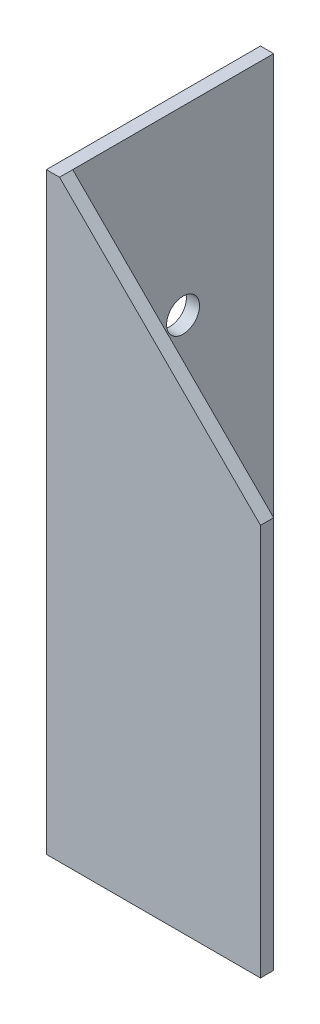
ISO-10303-21;
HEADER;
FILE_DESCRIPTION(('STEP AP214'),'2;1');
FILE_NAME('part.step','',(''),(''),'','','');
FILE_SCHEMA(('AUTOMOTIVE_DESIGN { 1 0 10303 214 1 1 1 1 }'));
ENDSEC;
DATA;
#1=APPLICATION_CONTEXT('core data for automotive mechanical design processes');
#2=APPLICATION_PROTOCOL_DEFINITION('international standard','automotive_design',2000,#1);
#3=PRODUCT_CONTEXT('',#1,'mechanical');
#4=PRODUCT('Part','Part','',(#3));
#5=PRODUCT_RELATED_PRODUCT_CATEGORY('part','',(#4));
#6=PRODUCT_DEFINITION_FORMATION('','',#4);
#7=PRODUCT_DEFINITION_CONTEXT('part definition',#1,'design');
#8=PRODUCT_DEFINITION('design','',#6,#7);
#9=PRODUCT_DEFINITION_SHAPE('','',#8);
#10=(LENGTH_UNIT() NAMED_UNIT(*) SI_UNIT(.MILLI.,.METRE.));
#11=(NAMED_UNIT(*) PLANE_ANGLE_UNIT() SI_UNIT($,.RADIAN.));
#12=(NAMED_UNIT(*) SI_UNIT($,.STERADIAN.) SOLID_ANGLE_UNIT());
#13=UNCERTAINTY_MEASURE_WITH_UNIT(LENGTH_MEASURE(1.E-05),#10,'distance_accuracy_value','');
#14=(GEOMETRIC_REPRESENTATION_CONTEXT(3) GLOBAL_UNCERTAINTY_ASSIGNED_CONTEXT((#13)) GLOBAL_UNIT_ASSIGNED_CONTEXT((#10,
#11,#12)) REPRESENTATION_CONTEXT('',''));
#15=CARTESIAN_POINT('',(0.,0.,0.));
#16=DIRECTION('',(0.,0.,1.));
#17=DIRECTION('',(1.,0.,0.));
#18=AXIS2_PLACEMENT_3D('',#15,#16,#17);
#19=CARTESIAN_POINT('',(4.,180.,0.));
#20=DIRECTION('',(-1.,0.,0.));
#21=DIRECTION('',(0.,0.,1.));
#22=AXIS2_PLACEMENT_3D('',#19,#20,#21);
#23=PLANE('',#22);
#24=CARTESIAN_POINT('',(4.,75.,-37.5000000000002));
#25=DIRECTION('',(-1.,0.,0.));
#26=DIRECTION('',(0.,0.,1.));
#27=AXIS2_PLACEMENT_3D('',#24,#25,#26);
#28=CIRCLE('',#27,5.);
#29=CARTESIAN_POINT('',(4.,75.,-32.5000000000002));
#30=VERTEX_POINT('',#29);
#31=EDGE_CURVE('E158',#30,#30,#28,.T.);
#32=ORIENTED_EDGE('',*,*,#31,.T.);
#33=EDGE_LOOP('',(#32));
#34=FACE_BOUND('',#33,.T.);
#35=CARTESIAN_POINT('',(4.,125.,-37.5000000000003));
#36=DIRECTION('',(-1.,0.,0.));
#37=DIRECTION('',(0.,0.,1.));
#38=AXIS2_PLACEMENT_3D('',#35,#36,#37);
#39=CIRCLE('',#38,5.00000000000001);
#40=CARTESIAN_POINT('',(4.,125.,-32.5000000000003));
#41=VERTEX_POINT('',#40);
#42=EDGE_CURVE('E161',#41,#41,#39,.T.);
#43=ORIENTED_EDGE('',*,*,#42,.T.);
#44=EDGE_LOOP('',(#43));
#45=FACE_BOUND('',#44,.T.);
#46=CARTESIAN_POINT('',(4.,25.,-37.5));
#47=DIRECTION('',(-1.,0.,0.));
#48=DIRECTION('',(0.,0.,1.));
#49=AXIS2_PLACEMENT_3D('',#46,#47,#48);
#50=CIRCLE('',#49,5.);
#51=CARTESIAN_POINT('',(4.,25.,-32.5));
#52=VERTEX_POINT('',#51);
#53=EDGE_CURVE('E133',#52,#52,#50,.T.);
#54=ORIENTED_EDGE('',*,*,#53,.T.);
#55=EDGE_LOOP('',(#54));
#56=FACE_BOUND('',#55,.T.);
#57=DIRECTION('',(0.,0.,-1.));
#58=VECTOR('',#57,1.);
#59=CARTESIAN_POINT('',(4.,0.,0.));
#60=LINE('',#59,#58);
#61=CARTESIAN_POINT('',(4.,0.,-4.));
#62=VERTEX_POINT('',#61);
#63=CARTESIAN_POINT('',(4.,0.,-65.));
#64=VERTEX_POINT('',#63);
#65=EDGE_CURVE('E131',#62,#64,#60,.T.);
#66=ORIENTED_EDGE('',*,*,#65,.T.);
#67=DIRECTION('',(0.,-1.,0.));
#68=VECTOR('',#67,1.);
#69=CARTESIAN_POINT('',(4.,180.,-65.));
#70=LINE('',#69,#68);
#71=CARTESIAN_POINT('',(4.,180.,-65.));
#72=VERTEX_POINT('',#71);
#73=EDGE_CURVE('E42',#72,#64,#70,.T.);
#74=ORIENTED_EDGE('',*,*,#73,.F.);
#75=DIRECTION('',(0.,0.,-1.));
#76=VECTOR('',#75,1.);
#77=CARTESIAN_POINT('',(4.,180.,0.));
#78=LINE('',#77,#76);
#79=CARTESIAN_POINT('',(4.,180.,-4.));
#80=VERTEX_POINT('',#79);
#81=EDGE_CURVE('E84',#80,#72,#78,.T.);
#82=ORIENTED_EDGE('',*,*,#81,.F.);
#83=DIRECTION('',(0.,-1.,0.));
#84=VECTOR('',#83,1.);
#85=CARTESIAN_POINT('',(4.,180.,-4.));
#86=LINE('',#85,#84);
#87=EDGE_CURVE('E116',#80,#62,#86,.T.);
#88=ORIENTED_EDGE('',*,*,#87,.T.);
#89=EDGE_LOOP('',(#66,#74,#82,#88));
#90=FACE_BOUND('',#89,.T.);
#91=ADVANCED_FACE('F34',(#34,#45,#56,#90),#23,.F.);
#92=CARTESIAN_POINT('',(0.,180.,-65.));
#93=DIRECTION('',(0.,0.,-1.));
#94=DIRECTION('',(-1.,0.,0.));
#95=AXIS2_PLACEMENT_3D('',#92,#93,#94);
#96=PLANE('',#95);
#97=DIRECTION('',(1.,0.,0.));
#98=VECTOR('',#97,1.);
#99=CARTESIAN_POINT('',(0.,0.,-65.));
#100=LINE('',#99,#98);
#101=CARTESIAN_POINT('',(0.,0.,-65.));
#102=VERTEX_POINT('',#101);
#103=EDGE_CURVE('E126',#102,#64,#100,.T.);
#104=ORIENTED_EDGE('',*,*,#103,.F.);
#105=DIRECTION('',(0.,-1.,0.));
#106=VECTOR('',#105,1.);
#107=CARTESIAN_POINT('',(0.,180.,-65.));
#108=LINE('',#107,#106);
#109=CARTESIAN_POINT('',(0.,180.,-65.));
#110=VERTEX_POINT('',#109);
#111=EDGE_CURVE('E114',#110,#102,#108,.T.);
#112=ORIENTED_EDGE('',*,*,#111,.F.);
#113=DIRECTION('',(1.,0.,0.));
#114=VECTOR('',#113,1.);
#115=CARTESIAN_POINT('',(0.,180.,-65.));
#116=LINE('',#115,#114);
#117=EDGE_CURVE('E128',#110,#72,#116,.T.);
#118=ORIENTED_EDGE('',*,*,#117,.T.);
#119=ORIENTED_EDGE('',*,*,#73,.T.);
#120=EDGE_LOOP('',(#104,#112,#118,#119));
#121=FACE_BOUND('',#120,.T.);
#122=ADVANCED_FACE('F124',(#121),#96,.T.);
#123=CARTESIAN_POINT('',(0.,180.,0.));
#124=DIRECTION('',(-1.,0.,0.));
#125=DIRECTION('',(0.,0.,1.));
#126=AXIS2_PLACEMENT_3D('',#123,#124,#125);
#127=PLANE('',#126);
#128=CARTESIAN_POINT('',(0.,75.,-37.5000000000002));
#129=DIRECTION('',(-1.,0.,0.));
#130=DIRECTION('',(0.,0.,1.));
#131=AXIS2_PLACEMENT_3D('',#128,#129,#130);
#132=CIRCLE('',#131,5.);
#133=CARTESIAN_POINT('',(0.,75.,-32.5000000000002));
#134=VERTEX_POINT('',#133);
#135=EDGE_CURVE('E164',#134,#134,#132,.T.);
#136=ORIENTED_EDGE('',*,*,#135,.F.);
#137=EDGE_LOOP('',(#136));
#138=FACE_BOUND('',#137,.T.);
#139=CARTESIAN_POINT('',(0.,125.,-37.5000000000003));
#140=DIRECTION('',(-1.,0.,0.));
#141=DIRECTION('',(0.,0.,1.));
#142=AXIS2_PLACEMENT_3D('',#139,#140,#141);
#143=CIRCLE('',#142,5.00000000000001);
#144=CARTESIAN_POINT('',(0.,125.,-32.5000000000003));
#145=VERTEX_POINT('',#144);
#146=EDGE_CURVE('E165',#145,#145,#143,.T.);
#147=ORIENTED_EDGE('',*,*,#146,.F.);
#148=EDGE_LOOP('',(#147));
#149=FACE_BOUND('',#148,.T.);
#150=CARTESIAN_POINT('',(0.,25.,-37.5));
#151=DIRECTION('',(-1.,0.,0.));
#152=DIRECTION('',(0.,0.,1.));
#153=AXIS2_PLACEMENT_3D('',#150,#151,#152);
#154=CIRCLE('',#153,5.);
#155=CARTESIAN_POINT('',(0.,25.,-32.5));
#156=VERTEX_POINT('',#155);
#157=EDGE_CURVE('E155',#156,#156,#154,.T.);
#158=ORIENTED_EDGE('',*,*,#157,.F.);
#159=EDGE_LOOP('',(#158));
#160=FACE_BOUND('',#159,.T.);
#161=DIRECTION('',(0.,0.,-1.));
#162=VECTOR('',#161,1.);
#163=CARTESIAN_POINT('',(0.,0.,0.));
#164=LINE('',#163,#162);
#165=CARTESIAN_POINT('',(0.,0.,0.));
#166=VERTEX_POINT('',#165);
#167=EDGE_CURVE('E137',#166,#102,#164,.T.);
#168=ORIENTED_EDGE('',*,*,#167,.F.);
#169=DIRECTION('',(0.,-1.,0.));
#170=VECTOR('',#169,1.);
#171=CARTESIAN_POINT('',(0.,180.,0.));
#172=LINE('',#171,#170);
#173=CARTESIAN_POINT('',(0.,180.,0.));
#174=VERTEX_POINT('',#173);
#175=EDGE_CURVE('E112',#174,#166,#172,.T.);
#176=ORIENTED_EDGE('',*,*,#175,.F.);
#177=DIRECTION('',(0.,0.,-1.));
#178=VECTOR('',#177,1.);
#179=CARTESIAN_POINT('',(0.,180.,0.));
#180=LINE('',#179,#178);
#181=EDGE_CURVE('E146',#174,#110,#180,.T.);
#182=ORIENTED_EDGE('',*,*,#181,.T.);
#183=ORIENTED_EDGE('',*,*,#111,.T.);
#184=EDGE_LOOP('',(#168,#176,#182,#183));
#185=FACE_BOUND('',#184,.T.);
#186=ADVANCED_FACE('F186',(#138,#149,#160,#185),#127,.T.);
#187=CARTESIAN_POINT('',(0.,180.,0.));
#188=DIRECTION('',(0.,0.,1.));
#189=DIRECTION('',(1.,0.,0.));
#190=AXIS2_PLACEMENT_3D('',#187,#188,#189);
#191=PLANE('',#190);
#192=DIRECTION('',(0.707106781186548,-0.707106781186548,0.));
#193=VECTOR('',#192,1.);
#194=CARTESIAN_POINT('',(4.,180.,0.));
#195=LINE('',#194,#193);
#196=CARTESIAN_POINT('',(4.,180.,0.));
#197=VERTEX_POINT('',#196);
#198=CARTESIAN_POINT('',(65.,119.,0.));
#199=VERTEX_POINT('',#198);
#200=EDGE_CURVE('E94',#197,#199,#195,.T.);
#201=ORIENTED_EDGE('',*,*,#200,.F.);
#202=DIRECTION('',(-1.,0.,0.));
#203=VECTOR('',#202,1.);
#204=CARTESIAN_POINT('',(0.,180.,0.));
#205=LINE('',#204,#203);
#206=EDGE_CURVE('E145',#197,#174,#205,.T.);
#207=ORIENTED_EDGE('',*,*,#206,.T.);
#208=ORIENTED_EDGE('',*,*,#175,.T.);
#209=DIRECTION('',(-1.,0.,0.));
#210=VECTOR('',#209,1.);
#211=CARTESIAN_POINT('',(0.,0.,0.));
#212=LINE('',#211,#210);
#213=CARTESIAN_POINT('',(65.,0.,0.));
#214=VERTEX_POINT('',#213);
#215=EDGE_CURVE('E110',#214,#166,#212,.T.);
#216=ORIENTED_EDGE('',*,*,#215,.F.);
#217=DIRECTION('',(0.,-1.,0.));
#218=VECTOR('',#217,1.);
#219=CARTESIAN_POINT('',(65.,180.,0.));
#220=LINE('',#219,#218);
#221=EDGE_CURVE('E105',#199,#214,#220,.T.);
#222=ORIENTED_EDGE('',*,*,#221,.F.);
#223=EDGE_LOOP('',(#201,#207,#208,#216,#222));
#224=FACE_BOUND('',#223,.T.);
#225=ADVANCED_FACE('F108',(#224),#191,.T.);
#226=CARTESIAN_POINT('',(65.,180.,-4.));
#227=DIRECTION('',(1.,0.,0.));
#228=DIRECTION('',(0.,0.,-1.));
#229=AXIS2_PLACEMENT_3D('',#226,#227,#228);
#230=PLANE('',#229);
#231=DIRECTION('',(0.,0.,1.));
#232=VECTOR('',#231,1.);
#233=CARTESIAN_POINT('',(65.,119.,-10.));
#234=LINE('',#233,#232);
#235=CARTESIAN_POINT('',(65.,119.,-4.));
#236=VERTEX_POINT('',#235);
#237=EDGE_CURVE('E97',#236,#199,#234,.T.);
#238=ORIENTED_EDGE('',*,*,#237,.T.);
#239=ORIENTED_EDGE('',*,*,#221,.T.);
#240=DIRECTION('',(0.,0.,1.));
#241=VECTOR('',#240,1.);
#242=CARTESIAN_POINT('',(65.,0.,-4.));
#243=LINE('',#242,#241);
#244=CARTESIAN_POINT('',(65.,0.,-4.));
#245=VERTEX_POINT('',#244);
#246=EDGE_CURVE('E143',#245,#214,#243,.T.);
#247=ORIENTED_EDGE('',*,*,#246,.F.);
#248=DIRECTION('',(0.,-1.,0.));
#249=VECTOR('',#248,1.);
#250=CARTESIAN_POINT('',(65.,180.,-4.));
#251=LINE('',#250,#249);
#252=EDGE_CURVE('E73',#236,#245,#251,.T.);
#253=ORIENTED_EDGE('',*,*,#252,.F.);
#254=EDGE_LOOP('',(#238,#239,#247,#253));
#255=FACE_BOUND('',#254,.T.);
#256=ADVANCED_FACE('F103',(#255),#230,.T.);
#257=CARTESIAN_POINT('',(0.,180.,-4.));
#258=DIRECTION('',(0.,0.,1.));
#259=DIRECTION('',(1.,0.,0.));
#260=AXIS2_PLACEMENT_3D('',#257,#258,#259);
#261=PLANE('',#260);
#262=ORIENTED_EDGE('',*,*,#87,.F.);
#263=DIRECTION('',(0.707106781186548,-0.707106781186548,0.));
#264=VECTOR('',#263,1.);
#265=CARTESIAN_POINT('',(2.,182.,-4.));
#266=LINE('',#265,#264);
#267=EDGE_CURVE('E50',#80,#236,#266,.T.);
#268=ORIENTED_EDGE('',*,*,#267,.T.);
#269=ORIENTED_EDGE('',*,*,#252,.T.);
#270=DIRECTION('',(1.,0.,0.));
#271=VECTOR('',#270,1.);
#272=CARTESIAN_POINT('',(0.,0.,-4.));
#273=LINE('',#272,#271);
#274=EDGE_CURVE('E77',#245,#62,#273,.F.);
#275=ORIENTED_EDGE('',*,*,#274,.T.);
#276=EDGE_LOOP('',(#262,#268,#269,#275));
#277=FACE_BOUND('',#276,.T.);
#278=ADVANCED_FACE('F170',(#277),#261,.F.);
#279=CARTESIAN_POINT('',(0.,180.,0.));
#280=DIRECTION('',(0.,-1.,0.));
#281=DIRECTION('',(-1.,0.,0.));
#282=AXIS2_PLACEMENT_3D('',#279,#280,#281);
#283=PLANE('',#282);
#284=ORIENTED_EDGE('',*,*,#206,.F.);
#285=DIRECTION('',(0.,0.,-1.));
#286=VECTOR('',#285,1.);
#287=CARTESIAN_POINT('',(4.,180.,0.));
#288=LINE('',#287,#286);
#289=EDGE_CURVE('E11',#197,#80,#288,.T.);
#290=ORIENTED_EDGE('',*,*,#289,.T.);
#291=ORIENTED_EDGE('',*,*,#81,.T.);
#292=ORIENTED_EDGE('',*,*,#117,.F.);
#293=ORIENTED_EDGE('',*,*,#181,.F.);
#294=EDGE_LOOP('',(#284,#290,#291,#292,#293));
#295=FACE_BOUND('',#294,.T.);
#296=ADVANCED_FACE('F172',(#295),#283,.F.);
#297=CARTESIAN_POINT('',(0.,0.,0.));
#298=DIRECTION('',(0.,-1.,0.));
#299=DIRECTION('',(-1.,0.,0.));
#300=AXIS2_PLACEMENT_3D('',#297,#298,#299);
#301=PLANE('',#300);
#302=ORIENTED_EDGE('',*,*,#65,.F.);
#303=ORIENTED_EDGE('',*,*,#274,.F.);
#304=ORIENTED_EDGE('',*,*,#246,.T.);
#305=ORIENTED_EDGE('',*,*,#215,.T.);
#306=ORIENTED_EDGE('',*,*,#167,.T.);
#307=ORIENTED_EDGE('',*,*,#103,.T.);
#308=EDGE_LOOP('',(#302,#303,#304,#305,#306,#307));
#309=FACE_BOUND('',#308,.T.);
#310=ADVANCED_FACE('F135',(#309),#301,.T.);
#311=CARTESIAN_POINT('',(10.,25.,-37.5));
#312=DIRECTION('',(-1.,0.,0.));
#313=DIRECTION('',(0.,0.,1.));
#314=AXIS2_PLACEMENT_3D('',#311,#312,#313);
#315=CYLINDRICAL_SURFACE('',#314,5.);
#316=ORIENTED_EDGE('',*,*,#157,.T.);
#317=EDGE_LOOP('',(#316));
#318=FACE_BOUND('',#317,.T.);
#319=ORIENTED_EDGE('',*,*,#53,.F.);
#320=EDGE_LOOP('',(#319));
#321=FACE_BOUND('',#320,.T.);
#322=ADVANCED_FACE('F193',(#318,#321),#315,.F.);
#323=CARTESIAN_POINT('',(10.,125.,-37.5000000000003));
#324=DIRECTION('',(-1.,0.,0.));
#325=DIRECTION('',(0.,0.,1.));
#326=AXIS2_PLACEMENT_3D('',#323,#324,#325);
#327=CYLINDRICAL_SURFACE('',#326,5.00000000000001);
#328=ORIENTED_EDGE('',*,*,#146,.T.);
#329=EDGE_LOOP('',(#328));
#330=FACE_BOUND('',#329,.T.);
#331=ORIENTED_EDGE('',*,*,#42,.F.);
#332=EDGE_LOOP('',(#331));
#333=FACE_BOUND('',#332,.T.);
#334=ADVANCED_FACE('F195',(#330,#333),#327,.F.);
#335=CARTESIAN_POINT('',(10.,75.,-37.5000000000002));
#336=DIRECTION('',(-1.,0.,0.));
#337=DIRECTION('',(0.,0.,1.));
#338=AXIS2_PLACEMENT_3D('',#335,#336,#337);
#339=CYLINDRICAL_SURFACE('',#338,5.);
#340=ORIENTED_EDGE('',*,*,#135,.T.);
#341=EDGE_LOOP('',(#340));
#342=FACE_BOUND('',#341,.T.);
#343=ORIENTED_EDGE('',*,*,#31,.F.);
#344=EDGE_LOOP('',(#343));
#345=FACE_BOUND('',#344,.T.);
#346=ADVANCED_FACE('F202',(#342,#345),#339,.F.);
#347=CARTESIAN_POINT('',(4.,180.,-10.));
#348=DIRECTION('',(-0.707106781186548,-0.707106781186548,0.));
#349=DIRECTION('',(0.707106781186548,-0.707106781186548,0.));
#350=AXIS2_PLACEMENT_3D('',#347,#348,#349);
#351=PLANE('',#350);
#352=ORIENTED_EDGE('',*,*,#289,.F.);
#353=ORIENTED_EDGE('',*,*,#200,.T.);
#354=ORIENTED_EDGE('',*,*,#237,.F.);
#355=ORIENTED_EDGE('',*,*,#267,.F.);
#356=EDGE_LOOP('',(#352,#353,#354,#355));
#357=FACE_BOUND('',#356,.T.);
#358=ADVANCED_FACE('F96',(#357),#351,.F.);
#359=CLOSED_SHELL('',(#91,#122,#186,#225,#256,#278,#296,#310,#322,#334,#346,#358));
#360=MANIFOLD_SOLID_BREP('B2',#359);
#361=ADVANCED_BREP_SHAPE_REPRESENTATION('',(#18,#360),#14);
#362=SHAPE_DEFINITION_REPRESENTATION(#9,#361);
ENDSEC;
END-ISO-10303-21;
